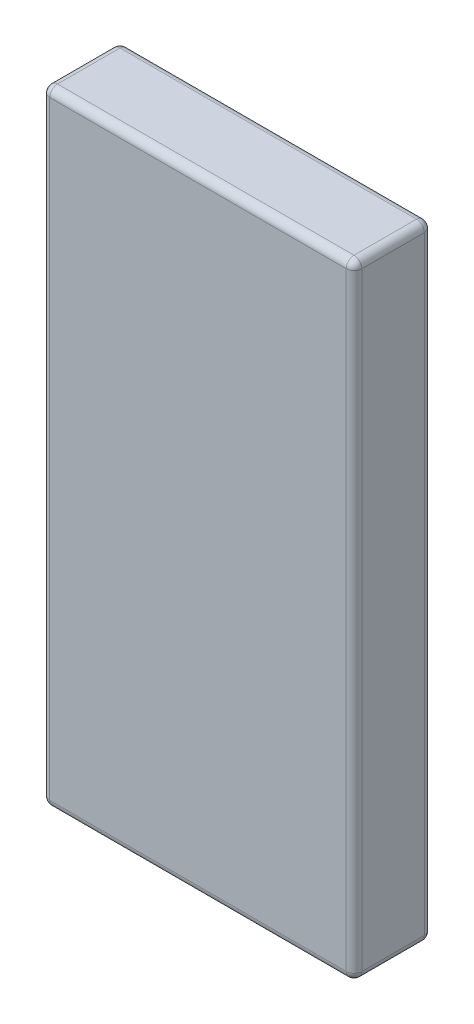
ISO-10303-21;
HEADER;
FILE_DESCRIPTION(('STEP AP214'),'2;1');
FILE_NAME('part.step','',(''),(''),'','','');
FILE_SCHEMA(('AUTOMOTIVE_DESIGN { 1 0 10303 214 1 1 1 1 }'));
ENDSEC;
DATA;
#1=APPLICATION_CONTEXT('core data for automotive mechanical design processes');
#2=APPLICATION_PROTOCOL_DEFINITION('international standard','automotive_design',2000,#1);
#3=PRODUCT_CONTEXT('',#1,'mechanical');
#4=PRODUCT('Part','Part','',(#3));
#5=PRODUCT_RELATED_PRODUCT_CATEGORY('part','',(#4));
#6=PRODUCT_DEFINITION_FORMATION('','',#4);
#7=PRODUCT_DEFINITION_CONTEXT('part definition',#1,'design');
#8=PRODUCT_DEFINITION('design','',#6,#7);
#9=PRODUCT_DEFINITION_SHAPE('','',#8);
#10=(LENGTH_UNIT() NAMED_UNIT(*) SI_UNIT(.MILLI.,.METRE.));
#11=(NAMED_UNIT(*) PLANE_ANGLE_UNIT() SI_UNIT($,.RADIAN.));
#12=(NAMED_UNIT(*) SI_UNIT($,.STERADIAN.) SOLID_ANGLE_UNIT());
#13=UNCERTAINTY_MEASURE_WITH_UNIT(LENGTH_MEASURE(1.E-05),#10,'distance_accuracy_value','');
#14=(GEOMETRIC_REPRESENTATION_CONTEXT(3) GLOBAL_UNCERTAINTY_ASSIGNED_CONTEXT((#13)) GLOBAL_UNIT_ASSIGNED_CONTEXT((#10,
#11,#12)) REPRESENTATION_CONTEXT('',''));
#15=CARTESIAN_POINT('',(0.,0.,0.));
#16=DIRECTION('',(0.,0.,1.));
#17=DIRECTION('',(1.,0.,0.));
#18=AXIS2_PLACEMENT_3D('',#15,#16,#17);
#19=CARTESIAN_POINT('',(12.7,25.4,6.35));
#20=DIRECTION('',(-1.,0.,0.));
#21=DIRECTION('',(0.,-1.,0.));
#22=AXIS2_PLACEMENT_3D('',#19,#20,#21);
#23=PLANE('',#22);
#24=DIRECTION('',(0.,0.,-1.));
#25=VECTOR('',#24,1.);
#26=CARTESIAN_POINT('',(12.7,24.765,6.35));
#27=LINE('',#26,#25);
#28=CARTESIAN_POINT('',(12.7,24.765,0.635));
#29=VERTEX_POINT('',#28);
#30=CARTESIAN_POINT('',(12.7,24.765,5.715));
#31=VERTEX_POINT('',#30);
#32=EDGE_CURVE('E175',#29,#31,#27,.F.);
#33=ORIENTED_EDGE('',*,*,#32,.T.);
#34=DIRECTION('',(0.,1.,0.));
#35=VECTOR('',#34,1.);
#36=CARTESIAN_POINT('',(12.7,-25.4,5.715));
#37=LINE('',#36,#35);
#38=CARTESIAN_POINT('',(12.7,-24.765,5.715));
#39=VERTEX_POINT('',#38);
#40=EDGE_CURVE('E180',#31,#39,#37,.F.);
#41=ORIENTED_EDGE('',*,*,#40,.T.);
#42=DIRECTION('',(0.,0.,-1.));
#43=VECTOR('',#42,1.);
#44=CARTESIAN_POINT('',(12.7,-24.765,6.35));
#45=LINE('',#44,#43);
#46=CARTESIAN_POINT('',(12.7,-24.765,0.635));
#47=VERTEX_POINT('',#46);
#48=EDGE_CURVE('E177',#39,#47,#45,.T.);
#49=ORIENTED_EDGE('',*,*,#48,.T.);
#50=DIRECTION('',(0.,1.,0.));
#51=VECTOR('',#50,1.);
#52=CARTESIAN_POINT('',(12.7,25.4,0.635));
#53=LINE('',#52,#51);
#54=EDGE_CURVE('E173',#47,#29,#53,.T.);
#55=ORIENTED_EDGE('',*,*,#54,.T.);
#56=EDGE_LOOP('',(#33,#41,#49,#55));
#57=FACE_BOUND('',#56,.T.);
#58=ADVANCED_FACE('F40',(#57),#23,.F.);
#59=CARTESIAN_POINT('',(-12.7,25.4,6.35));
#60=DIRECTION('',(0.,-1.,0.));
#61=DIRECTION('',(0.,0.,-1.));
#62=AXIS2_PLACEMENT_3D('',#59,#60,#61);
#63=PLANE('',#62);
#64=DIRECTION('',(0.,0.,-1.));
#65=VECTOR('',#64,1.);
#66=CARTESIAN_POINT('',(-12.065,25.4,6.35));
#67=LINE('',#66,#65);
#68=CARTESIAN_POINT('',(-12.065,25.4,0.635));
#69=VERTEX_POINT('',#68);
#70=CARTESIAN_POINT('',(-12.065,25.4,5.715));
#71=VERTEX_POINT('',#70);
#72=EDGE_CURVE('E184',#69,#71,#67,.F.);
#73=ORIENTED_EDGE('',*,*,#72,.T.);
#74=DIRECTION('',(-1.,0.,0.));
#75=VECTOR('',#74,1.);
#76=CARTESIAN_POINT('',(12.7,25.4,5.715));
#77=LINE('',#76,#75);
#78=CARTESIAN_POINT('',(12.065,25.4,5.715));
#79=VERTEX_POINT('',#78);
#80=EDGE_CURVE('E189',#71,#79,#77,.F.);
#81=ORIENTED_EDGE('',*,*,#80,.T.);
#82=DIRECTION('',(0.,0.,-1.));
#83=VECTOR('',#82,1.);
#84=CARTESIAN_POINT('',(12.065,25.4,6.35));
#85=LINE('',#84,#83);
#86=CARTESIAN_POINT('',(12.065,25.4,0.635));
#87=VERTEX_POINT('',#86);
#88=EDGE_CURVE('E186',#79,#87,#85,.T.);
#89=ORIENTED_EDGE('',*,*,#88,.T.);
#90=DIRECTION('',(-1.,0.,0.));
#91=VECTOR('',#90,1.);
#92=CARTESIAN_POINT('',(-12.7,25.4,0.635));
#93=LINE('',#92,#91);
#94=EDGE_CURVE('E182',#87,#69,#93,.T.);
#95=ORIENTED_EDGE('',*,*,#94,.T.);
#96=EDGE_LOOP('',(#73,#81,#89,#95));
#97=FACE_BOUND('',#96,.T.);
#98=ADVANCED_FACE('F298',(#97),#63,.F.);
#99=CARTESIAN_POINT('',(-12.7,25.4,6.35));
#100=DIRECTION('',(1.,0.,0.));
#101=DIRECTION('',(0.,1.,0.));
#102=AXIS2_PLACEMENT_3D('',#99,#100,#101);
#103=PLANE('',#102);
#104=DIRECTION('',(0.,0.,-1.));
#105=VECTOR('',#104,1.);
#106=CARTESIAN_POINT('',(-12.7,-24.765,6.35));
#107=LINE('',#106,#105);
#108=CARTESIAN_POINT('',(-12.7,-24.765,0.635));
#109=VERTEX_POINT('',#108);
#110=CARTESIAN_POINT('',(-12.7,-24.765,5.715));
#111=VERTEX_POINT('',#110);
#112=EDGE_CURVE('E135',#109,#111,#107,.F.);
#113=ORIENTED_EDGE('',*,*,#112,.T.);
#114=DIRECTION('',(0.,-1.,0.));
#115=VECTOR('',#114,1.);
#116=CARTESIAN_POINT('',(-12.7,25.4,5.715));
#117=LINE('',#116,#115);
#118=CARTESIAN_POINT('',(-12.7,24.765,5.715));
#119=VERTEX_POINT('',#118);
#120=EDGE_CURVE('E171',#111,#119,#117,.F.);
#121=ORIENTED_EDGE('',*,*,#120,.T.);
#122=DIRECTION('',(0.,0.,-1.));
#123=VECTOR('',#122,1.);
#124=CARTESIAN_POINT('',(-12.7,24.765,6.35));
#125=LINE('',#124,#123);
#126=CARTESIAN_POINT('',(-12.7,24.765,0.635));
#127=VERTEX_POINT('',#126);
#128=EDGE_CURVE('E168',#119,#127,#125,.T.);
#129=ORIENTED_EDGE('',*,*,#128,.T.);
#130=DIRECTION('',(0.,-1.,0.));
#131=VECTOR('',#130,1.);
#132=CARTESIAN_POINT('',(-12.7,25.4,0.635));
#133=LINE('',#132,#131);
#134=EDGE_CURVE('E163',#127,#109,#133,.T.);
#135=ORIENTED_EDGE('',*,*,#134,.T.);
#136=EDGE_LOOP('',(#113,#121,#129,#135));
#137=FACE_BOUND('',#136,.T.);
#138=ADVANCED_FACE('F314',(#137),#103,.F.);
#139=CARTESIAN_POINT('',(-12.7,-25.4,6.35));
#140=DIRECTION('',(0.,1.,0.));
#141=DIRECTION('',(0.,0.,1.));
#142=AXIS2_PLACEMENT_3D('',#139,#140,#141);
#143=PLANE('',#142);
#144=DIRECTION('',(0.,0.,-1.));
#145=VECTOR('',#144,1.);
#146=CARTESIAN_POINT('',(12.065,-25.4,6.35));
#147=LINE('',#146,#145);
#148=CARTESIAN_POINT('',(12.065,-25.4,0.635));
#149=VERTEX_POINT('',#148);
#150=CARTESIAN_POINT('',(12.065,-25.4,5.715));
#151=VERTEX_POINT('',#150);
#152=EDGE_CURVE('E156',#149,#151,#147,.F.);
#153=ORIENTED_EDGE('',*,*,#152,.T.);
#154=DIRECTION('',(1.,0.,0.));
#155=VECTOR('',#154,1.);
#156=CARTESIAN_POINT('',(-12.7,-25.4,5.715));
#157=LINE('',#156,#155);
#158=CARTESIAN_POINT('',(-12.065,-25.4,5.715));
#159=VERTEX_POINT('',#158);
#160=EDGE_CURVE('E160',#151,#159,#157,.F.);
#161=ORIENTED_EDGE('',*,*,#160,.T.);
#162=DIRECTION('',(0.,0.,-1.));
#163=VECTOR('',#162,1.);
#164=CARTESIAN_POINT('',(-12.065,-25.4,6.35));
#165=LINE('',#164,#163);
#166=CARTESIAN_POINT('',(-12.065,-25.4,0.635));
#167=VERTEX_POINT('',#166);
#168=EDGE_CURVE('E133',#159,#167,#165,.T.);
#169=ORIENTED_EDGE('',*,*,#168,.T.);
#170=DIRECTION('',(1.,0.,0.));
#171=VECTOR('',#170,1.);
#172=CARTESIAN_POINT('',(-12.7,-25.4,0.635));
#173=LINE('',#172,#171);
#174=EDGE_CURVE('E150',#167,#149,#173,.T.);
#175=ORIENTED_EDGE('',*,*,#174,.T.);
#176=EDGE_LOOP('',(#153,#161,#169,#175));
#177=FACE_BOUND('',#176,.T.);
#178=ADVANCED_FACE('F158',(#177),#143,.F.);
#179=CARTESIAN_POINT('',(0.,0.,6.35));
#180=DIRECTION('',(0.,0.,1.));
#181=DIRECTION('',(1.,0.,0.));
#182=AXIS2_PLACEMENT_3D('',#179,#180,#181);
#183=PLANE('',#182);
#184=DIRECTION('',(0.,-1.,0.));
#185=VECTOR('',#184,1.);
#186=CARTESIAN_POINT('',(-12.065,-25.4,6.35));
#187=LINE('',#186,#185);
#188=CARTESIAN_POINT('',(-12.065,24.765,6.35));
#189=VERTEX_POINT('',#188);
#190=CARTESIAN_POINT('',(-12.065,-24.765,6.35));
#191=VERTEX_POINT('',#190);
#192=EDGE_CURVE('E195',#189,#191,#187,.T.);
#193=ORIENTED_EDGE('',*,*,#192,.T.);
#194=DIRECTION('',(1.,0.,0.));
#195=VECTOR('',#194,1.);
#196=CARTESIAN_POINT('',(12.7,-24.765,6.35));
#197=LINE('',#196,#195);
#198=CARTESIAN_POINT('',(12.065,-24.765,6.35));
#199=VERTEX_POINT('',#198);
#200=EDGE_CURVE('E197',#191,#199,#197,.T.);
#201=ORIENTED_EDGE('',*,*,#200,.T.);
#202=DIRECTION('',(0.,1.,0.));
#203=VECTOR('',#202,1.);
#204=CARTESIAN_POINT('',(12.065,25.4,6.35));
#205=LINE('',#204,#203);
#206=CARTESIAN_POINT('',(12.065,24.765,6.35));
#207=VERTEX_POINT('',#206);
#208=EDGE_CURVE('E191',#199,#207,#205,.T.);
#209=ORIENTED_EDGE('',*,*,#208,.T.);
#210=DIRECTION('',(-1.,0.,0.));
#211=VECTOR('',#210,1.);
#212=CARTESIAN_POINT('',(-12.7,24.765,6.35));
#213=LINE('',#212,#211);
#214=EDGE_CURVE('E193',#207,#189,#213,.T.);
#215=ORIENTED_EDGE('',*,*,#214,.T.);
#216=EDGE_LOOP('',(#193,#201,#209,#215));
#217=FACE_BOUND('',#216,.T.);
#218=ADVANCED_FACE('F278',(#217),#183,.T.);
#219=CARTESIAN_POINT('',(0.,0.,0.));
#220=DIRECTION('',(0.,0.,1.));
#221=DIRECTION('',(1.,0.,0.));
#222=AXIS2_PLACEMENT_3D('',#219,#220,#221);
#223=PLANE('',#222);
#224=DIRECTION('',(0.,-1.,0.));
#225=VECTOR('',#224,1.);
#226=CARTESIAN_POINT('',(-12.065,0.,0.));
#227=LINE('',#226,#225);
#228=CARTESIAN_POINT('',(-12.065,-24.765,0.));
#229=VERTEX_POINT('',#228);
#230=CARTESIAN_POINT('',(-12.065,24.765,0.));
#231=VERTEX_POINT('',#230);
#232=EDGE_CURVE('E49',#229,#231,#227,.F.);
#233=ORIENTED_EDGE('',*,*,#232,.T.);
#234=DIRECTION('',(-1.,0.,0.));
#235=VECTOR('',#234,1.);
#236=CARTESIAN_POINT('',(0.,24.765,0.));
#237=LINE('',#236,#235);
#238=CARTESIAN_POINT('',(12.065,24.765,0.));
#239=VERTEX_POINT('',#238);
#240=EDGE_CURVE('E11',#231,#239,#237,.F.);
#241=ORIENTED_EDGE('',*,*,#240,.T.);
#242=DIRECTION('',(0.,1.,0.));
#243=VECTOR('',#242,1.);
#244=CARTESIAN_POINT('',(12.065,0.,0.));
#245=LINE('',#244,#243);
#246=CARTESIAN_POINT('',(12.065,-24.765,0.));
#247=VERTEX_POINT('',#246);
#248=EDGE_CURVE('E200',#239,#247,#245,.F.);
#249=ORIENTED_EDGE('',*,*,#248,.T.);
#250=DIRECTION('',(1.,0.,0.));
#251=VECTOR('',#250,1.);
#252=CARTESIAN_POINT('',(0.,-24.765,0.));
#253=LINE('',#252,#251);
#254=EDGE_CURVE('E60',#247,#229,#253,.F.);
#255=ORIENTED_EDGE('',*,*,#254,.T.);
#256=EDGE_LOOP('',(#233,#241,#249,#255));
#257=FACE_BOUND('',#256,.T.);
#258=ADVANCED_FACE('F524',(#257),#223,.F.);
#259=CARTESIAN_POINT('',(12.065,24.765,6.35));
#260=DIRECTION('',(0.,0.,-1.));
#261=DIRECTION('',(-1.,0.,0.));
#262=AXIS2_PLACEMENT_3D('',#259,#260,#261);
#263=CYLINDRICAL_SURFACE('',#262,0.635);
#264=CARTESIAN_POINT('',(12.065,24.765,5.715));
#265=DIRECTION('',(0.,0.,1.));
#266=DIRECTION('',(1.,0.,0.));
#267=AXIS2_PLACEMENT_3D('',#264,#265,#266);
#268=CIRCLE('',#267,0.635);
#269=EDGE_CURVE('E44',#31,#79,#268,.T.);
#270=ORIENTED_EDGE('',*,*,#269,.F.);
#271=ORIENTED_EDGE('',*,*,#32,.F.);
#272=CARTESIAN_POINT('',(12.065,24.765,0.635));
#273=DIRECTION('',(0.,0.,-1.));
#274=DIRECTION('',(-1.,0.,0.));
#275=AXIS2_PLACEMENT_3D('',#272,#273,#274);
#276=CIRCLE('',#275,0.635);
#277=EDGE_CURVE('E254',#87,#29,#276,.T.);
#278=ORIENTED_EDGE('',*,*,#277,.F.);
#279=ORIENTED_EDGE('',*,*,#88,.F.);
#280=EDGE_LOOP('',(#270,#271,#278,#279));
#281=FACE_BOUND('',#280,.T.);
#282=ADVANCED_FACE('F42',(#281),#263,.T.);
#283=CARTESIAN_POINT('',(12.065,24.765,5.715));
#284=DIRECTION('',(0.,1.,0.));
#285=DIRECTION('',(0.,0.,1.));
#286=AXIS2_PLACEMENT_3D('',#283,#284,#285);
#287=SPHERICAL_SURFACE('',#286,0.635);
#288=CARTESIAN_POINT('',(12.065,24.765,5.715));
#289=DIRECTION('',(0.,1.,0.));
#290=DIRECTION('',(0.,0.,1.));
#291=AXIS2_PLACEMENT_3D('',#288,#289,#290);
#292=CIRCLE('',#291,0.635);
#293=EDGE_CURVE('E249',#31,#207,#292,.F.);
#294=ORIENTED_EDGE('',*,*,#293,.F.);
#295=ORIENTED_EDGE('',*,*,#269,.T.);
#296=CARTESIAN_POINT('',(12.065,24.765,5.715));
#297=DIRECTION('',(1.,0.,0.));
#298=DIRECTION('',(0.,0.,-1.));
#299=AXIS2_PLACEMENT_3D('',#296,#297,#298);
#300=CIRCLE('',#299,0.635);
#301=EDGE_CURVE('E252',#207,#79,#300,.F.);
#302=ORIENTED_EDGE('',*,*,#301,.F.);
#303=EDGE_LOOP('',(#294,#295,#302));
#304=FACE_BOUND('',#303,.T.);
#305=ADVANCED_FACE('F265',(#304),#287,.T.);
#306=CARTESIAN_POINT('',(12.065,24.765,0.635));
#307=DIRECTION('',(1.,0.,0.));
#308=DIRECTION('',(0.,0.,-1.));
#309=AXIS2_PLACEMENT_3D('',#306,#307,#308);
#310=SPHERICAL_SURFACE('',#309,0.635);
#311=CARTESIAN_POINT('',(12.065,24.765,0.635));
#312=DIRECTION('',(1.,0.,0.));
#313=DIRECTION('',(0.,0.,-1.));
#314=AXIS2_PLACEMENT_3D('',#311,#312,#313);
#315=CIRCLE('',#314,0.635);
#316=EDGE_CURVE('E243',#87,#239,#315,.F.);
#317=ORIENTED_EDGE('',*,*,#316,.F.);
#318=ORIENTED_EDGE('',*,*,#277,.T.);
#319=CARTESIAN_POINT('',(12.065,24.765,0.635));
#320=DIRECTION('',(0.,1.,0.));
#321=DIRECTION('',(0.,0.,1.));
#322=AXIS2_PLACEMENT_3D('',#319,#320,#321);
#323=CIRCLE('',#322,0.635);
#324=EDGE_CURVE('E246',#239,#29,#323,.F.);
#325=ORIENTED_EDGE('',*,*,#324,.F.);
#326=EDGE_LOOP('',(#317,#318,#325));
#327=FACE_BOUND('',#326,.T.);
#328=ADVANCED_FACE('F497',(#327),#310,.T.);
#329=CARTESIAN_POINT('',(0.,24.765,5.715));
#330=DIRECTION('',(1.,0.,0.));
#331=DIRECTION('',(0.,0.,-1.));
#332=AXIS2_PLACEMENT_3D('',#329,#330,#331);
#333=CYLINDRICAL_SURFACE('',#332,0.635);
#334=ORIENTED_EDGE('',*,*,#301,.T.);
#335=ORIENTED_EDGE('',*,*,#80,.F.);
#336=CARTESIAN_POINT('',(-12.065,24.765,5.715));
#337=DIRECTION('',(-1.,0.,0.));
#338=DIRECTION('',(0.,0.,1.));
#339=AXIS2_PLACEMENT_3D('',#336,#337,#338);
#340=CIRCLE('',#339,0.635);
#341=EDGE_CURVE('E237',#189,#71,#340,.T.);
#342=ORIENTED_EDGE('',*,*,#341,.F.);
#343=ORIENTED_EDGE('',*,*,#214,.F.);
#344=EDGE_LOOP('',(#334,#335,#342,#343));
#345=FACE_BOUND('',#344,.T.);
#346=ADVANCED_FACE('F273',(#345),#333,.T.);
#347=CARTESIAN_POINT('',(12.065,0.,5.715));
#348=DIRECTION('',(0.,-1.,0.));
#349=DIRECTION('',(1.,0.,0.));
#350=AXIS2_PLACEMENT_3D('',#347,#348,#349);
#351=CYLINDRICAL_SURFACE('',#350,0.635);
#352=ORIENTED_EDGE('',*,*,#293,.T.);
#353=ORIENTED_EDGE('',*,*,#208,.F.);
#354=CARTESIAN_POINT('',(12.065,-24.765,5.715));
#355=DIRECTION('',(0.,-1.,0.));
#356=DIRECTION('',(0.,0.,-1.));
#357=AXIS2_PLACEMENT_3D('',#354,#355,#356);
#358=CIRCLE('',#357,0.635);
#359=EDGE_CURVE('E234',#39,#199,#358,.T.);
#360=ORIENTED_EDGE('',*,*,#359,.F.);
#361=ORIENTED_EDGE('',*,*,#40,.F.);
#362=EDGE_LOOP('',(#352,#353,#360,#361));
#363=FACE_BOUND('',#362,.T.);
#364=ADVANCED_FACE('F284',(#363),#351,.T.);
#365=CARTESIAN_POINT('',(12.065,-24.765,6.35));
#366=DIRECTION('',(0.,0.,-1.));
#367=DIRECTION('',(-1.,0.,0.));
#368=AXIS2_PLACEMENT_3D('',#365,#366,#367);
#369=CYLINDRICAL_SURFACE('',#368,0.635);
#370=CARTESIAN_POINT('',(12.065,-24.765,0.635));
#371=DIRECTION('',(0.,0.,-1.));
#372=DIRECTION('',(-1.,0.,0.));
#373=AXIS2_PLACEMENT_3D('',#370,#371,#372);
#374=CIRCLE('',#373,0.635);
#375=EDGE_CURVE('E228',#47,#149,#374,.T.);
#376=ORIENTED_EDGE('',*,*,#375,.F.);
#377=ORIENTED_EDGE('',*,*,#48,.F.);
#378=CARTESIAN_POINT('',(12.065,-24.765,5.715));
#379=DIRECTION('',(0.,0.,1.));
#380=DIRECTION('',(1.,0.,0.));
#381=AXIS2_PLACEMENT_3D('',#378,#379,#380);
#382=CIRCLE('',#381,0.635);
#383=EDGE_CURVE('E231',#151,#39,#382,.T.);
#384=ORIENTED_EDGE('',*,*,#383,.F.);
#385=ORIENTED_EDGE('',*,*,#152,.F.);
#386=EDGE_LOOP('',(#376,#377,#384,#385));
#387=FACE_BOUND('',#386,.T.);
#388=ADVANCED_FACE('F290',(#387),#369,.T.);
#389=CARTESIAN_POINT('',(12.065,25.4,0.635));
#390=DIRECTION('',(0.,1.,0.));
#391=DIRECTION('',(-1.,0.,0.));
#392=AXIS2_PLACEMENT_3D('',#389,#390,#391);
#393=CYLINDRICAL_SURFACE('',#392,0.635);
#394=ORIENTED_EDGE('',*,*,#324,.T.);
#395=ORIENTED_EDGE('',*,*,#54,.F.);
#396=CARTESIAN_POINT('',(12.065,-24.765,0.635));
#397=DIRECTION('',(0.,-1.,0.));
#398=DIRECTION('',(1.,0.,0.));
#399=AXIS2_PLACEMENT_3D('',#396,#397,#398);
#400=CIRCLE('',#399,0.635);
#401=EDGE_CURVE('E226',#247,#47,#400,.T.);
#402=ORIENTED_EDGE('',*,*,#401,.F.);
#403=ORIENTED_EDGE('',*,*,#248,.F.);
#404=EDGE_LOOP('',(#394,#395,#402,#403));
#405=FACE_BOUND('',#404,.T.);
#406=ADVANCED_FACE('F296',(#405),#393,.T.);
#407=CARTESIAN_POINT('',(-12.7,24.765,0.635));
#408=DIRECTION('',(-1.,0.,0.));
#409=DIRECTION('',(0.,0.,1.));
#410=AXIS2_PLACEMENT_3D('',#407,#408,#409);
#411=CYLINDRICAL_SURFACE('',#410,0.635);
#412=ORIENTED_EDGE('',*,*,#316,.T.);
#413=ORIENTED_EDGE('',*,*,#240,.F.);
#414=CARTESIAN_POINT('',(-12.065,24.765,0.635));
#415=DIRECTION('',(-1.,0.,0.));
#416=DIRECTION('',(0.,0.,1.));
#417=AXIS2_PLACEMENT_3D('',#414,#415,#416);
#418=CIRCLE('',#417,0.635);
#419=EDGE_CURVE('E223',#69,#231,#418,.T.);
#420=ORIENTED_EDGE('',*,*,#419,.F.);
#421=ORIENTED_EDGE('',*,*,#94,.F.);
#422=EDGE_LOOP('',(#412,#413,#420,#421));
#423=FACE_BOUND('',#422,.T.);
#424=ADVANCED_FACE('F307',(#423),#411,.T.);
#425=CARTESIAN_POINT('',(-12.065,24.765,6.35));
#426=DIRECTION('',(0.,0.,-1.));
#427=DIRECTION('',(-1.,0.,0.));
#428=AXIS2_PLACEMENT_3D('',#425,#426,#427);
#429=CYLINDRICAL_SURFACE('',#428,0.635);
#430=CARTESIAN_POINT('',(-12.065,24.765,5.715));
#431=DIRECTION('',(0.,0.,1.));
#432=DIRECTION('',(1.,0.,0.));
#433=AXIS2_PLACEMENT_3D('',#430,#431,#432);
#434=CIRCLE('',#433,0.635);
#435=EDGE_CURVE('E240',#71,#119,#434,.T.);
#436=ORIENTED_EDGE('',*,*,#435,.F.);
#437=ORIENTED_EDGE('',*,*,#72,.F.);
#438=CARTESIAN_POINT('',(-12.065,24.765,0.635));
#439=DIRECTION('',(0.,0.,-1.));
#440=DIRECTION('',(-1.,0.,0.));
#441=AXIS2_PLACEMENT_3D('',#438,#439,#440);
#442=CIRCLE('',#441,0.635);
#443=EDGE_CURVE('E220',#127,#69,#442,.T.);
#444=ORIENTED_EDGE('',*,*,#443,.F.);
#445=ORIENTED_EDGE('',*,*,#128,.F.);
#446=EDGE_LOOP('',(#436,#437,#444,#445));
#447=FACE_BOUND('',#446,.T.);
#448=ADVANCED_FACE('F303',(#447),#429,.T.);
#449=CARTESIAN_POINT('',(-12.065,24.765,5.715));
#450=DIRECTION('',(0.,1.,0.));
#451=DIRECTION('',(0.,0.,1.));
#452=AXIS2_PLACEMENT_3D('',#449,#450,#451);
#453=SPHERICAL_SURFACE('',#452,0.635);
#454=ORIENTED_EDGE('',*,*,#341,.T.);
#455=ORIENTED_EDGE('',*,*,#435,.T.);
#456=CARTESIAN_POINT('',(-12.065,24.765,5.715));
#457=DIRECTION('',(0.,1.,0.));
#458=DIRECTION('',(0.,0.,1.));
#459=AXIS2_PLACEMENT_3D('',#456,#457,#458);
#460=CIRCLE('',#459,0.635);
#461=EDGE_CURVE('E217',#189,#119,#460,.F.);
#462=ORIENTED_EDGE('',*,*,#461,.F.);
#463=EDGE_LOOP('',(#454,#455,#462));
#464=FACE_BOUND('',#463,.T.);
#465=ADVANCED_FACE('F317',(#464),#453,.T.);
#466=CARTESIAN_POINT('',(12.065,-24.765,5.715));
#467=DIRECTION('',(1.,0.,0.));
#468=DIRECTION('',(0.,1.,0.));
#469=AXIS2_PLACEMENT_3D('',#466,#467,#468);
#470=SPHERICAL_SURFACE('',#469,0.635);
#471=ORIENTED_EDGE('',*,*,#383,.T.);
#472=ORIENTED_EDGE('',*,*,#359,.T.);
#473=CARTESIAN_POINT('',(12.065,-24.765,5.715));
#474=DIRECTION('',(1.,0.,0.));
#475=DIRECTION('',(0.,0.,-1.));
#476=AXIS2_PLACEMENT_3D('',#473,#474,#475);
#477=CIRCLE('',#476,0.635);
#478=EDGE_CURVE('E215',#151,#199,#477,.F.);
#479=ORIENTED_EDGE('',*,*,#478,.F.);
#480=EDGE_LOOP('',(#471,#472,#479));
#481=FACE_BOUND('',#480,.T.);
#482=ADVANCED_FACE('F327',(#481),#470,.T.);
#483=CARTESIAN_POINT('',(12.065,-24.765,0.635));
#484=DIRECTION('',(1.,0.,0.));
#485=DIRECTION('',(0.,1.,0.));
#486=AXIS2_PLACEMENT_3D('',#483,#484,#485);
#487=SPHERICAL_SURFACE('',#486,0.635);
#488=ORIENTED_EDGE('',*,*,#401,.T.);
#489=ORIENTED_EDGE('',*,*,#375,.T.);
#490=CARTESIAN_POINT('',(12.065,-24.765,0.635));
#491=DIRECTION('',(1.,0.,0.));
#492=DIRECTION('',(0.,0.,-1.));
#493=AXIS2_PLACEMENT_3D('',#490,#491,#492);
#494=CIRCLE('',#493,0.635);
#495=EDGE_CURVE('E153',#247,#149,#494,.F.);
#496=ORIENTED_EDGE('',*,*,#495,.F.);
#497=EDGE_LOOP('',(#488,#489,#496));
#498=FACE_BOUND('',#497,.T.);
#499=ADVANCED_FACE('F329',(#498),#487,.T.);
#500=CARTESIAN_POINT('',(-12.065,24.765,0.635));
#501=DIRECTION('',(0.,1.,0.));
#502=DIRECTION('',(0.,0.,1.));
#503=AXIS2_PLACEMENT_3D('',#500,#501,#502);
#504=SPHERICAL_SURFACE('',#503,0.635);
#505=ORIENTED_EDGE('',*,*,#443,.T.);
#506=ORIENTED_EDGE('',*,*,#419,.T.);
#507=CARTESIAN_POINT('',(-12.065,24.765,0.635));
#508=DIRECTION('',(0.,1.,0.));
#509=DIRECTION('',(0.,0.,1.));
#510=AXIS2_PLACEMENT_3D('',#507,#508,#509);
#511=CIRCLE('',#510,0.635);
#512=EDGE_CURVE('E211',#127,#231,#511,.F.);
#513=ORIENTED_EDGE('',*,*,#512,.F.);
#514=EDGE_LOOP('',(#505,#506,#513));
#515=FACE_BOUND('',#514,.T.);
#516=ADVANCED_FACE('F309',(#515),#504,.T.);
#517=CARTESIAN_POINT('',(-12.065,0.,5.715));
#518=DIRECTION('',(0.,1.,0.));
#519=DIRECTION('',(-1.,0.,0.));
#520=AXIS2_PLACEMENT_3D('',#517,#518,#519);
#521=CYLINDRICAL_SURFACE('',#520,0.635);
#522=ORIENTED_EDGE('',*,*,#461,.T.);
#523=ORIENTED_EDGE('',*,*,#120,.F.);
#524=CARTESIAN_POINT('',(-12.065,-24.765,5.715));
#525=DIRECTION('',(0.,-1.,0.));
#526=DIRECTION('',(0.,0.,-1.));
#527=AXIS2_PLACEMENT_3D('',#524,#525,#526);
#528=CIRCLE('',#527,0.635);
#529=EDGE_CURVE('E208',#191,#111,#528,.T.);
#530=ORIENTED_EDGE('',*,*,#529,.F.);
#531=ORIENTED_EDGE('',*,*,#192,.F.);
#532=EDGE_LOOP('',(#522,#523,#530,#531));
#533=FACE_BOUND('',#532,.T.);
#534=ADVANCED_FACE('F319',(#533),#521,.T.);
#535=CARTESIAN_POINT('',(0.,-24.765,5.715));
#536=DIRECTION('',(-1.,0.,0.));
#537=DIRECTION('',(0.,0.,1.));
#538=AXIS2_PLACEMENT_3D('',#535,#536,#537);
#539=CYLINDRICAL_SURFACE('',#538,0.635);
#540=ORIENTED_EDGE('',*,*,#478,.T.);
#541=ORIENTED_EDGE('',*,*,#200,.F.);
#542=CARTESIAN_POINT('',(-12.065,-24.765,5.715));
#543=DIRECTION('',(-1.,0.,0.));
#544=DIRECTION('',(0.,0.,1.));
#545=AXIS2_PLACEMENT_3D('',#542,#543,#544);
#546=CIRCLE('',#545,0.635);
#547=EDGE_CURVE('E147',#159,#191,#546,.T.);
#548=ORIENTED_EDGE('',*,*,#547,.F.);
#549=ORIENTED_EDGE('',*,*,#160,.F.);
#550=EDGE_LOOP('',(#540,#541,#548,#549));
#551=FACE_BOUND('',#550,.T.);
#552=ADVANCED_FACE('F325',(#551),#539,.T.);
#553=CARTESIAN_POINT('',(-12.7,-24.765,0.635));
#554=DIRECTION('',(1.,0.,0.));
#555=DIRECTION('',(0.,0.,-1.));
#556=AXIS2_PLACEMENT_3D('',#553,#554,#555);
#557=CYLINDRICAL_SURFACE('',#556,0.635);
#558=ORIENTED_EDGE('',*,*,#495,.T.);
#559=ORIENTED_EDGE('',*,*,#174,.F.);
#560=CARTESIAN_POINT('',(-12.065,-24.765,0.635));
#561=DIRECTION('',(-1.,0.,0.));
#562=DIRECTION('',(0.,0.,1.));
#563=AXIS2_PLACEMENT_3D('',#560,#561,#562);
#564=CIRCLE('',#563,0.635);
#565=EDGE_CURVE('E141',#229,#167,#564,.T.);
#566=ORIENTED_EDGE('',*,*,#565,.F.);
#567=ORIENTED_EDGE('',*,*,#254,.F.);
#568=EDGE_LOOP('',(#558,#559,#566,#567));
#569=FACE_BOUND('',#568,.T.);
#570=ADVANCED_FACE('F151',(#569),#557,.T.);
#571=CARTESIAN_POINT('',(-12.065,25.4,0.635));
#572=DIRECTION('',(0.,-1.,0.));
#573=DIRECTION('',(1.,0.,0.));
#574=AXIS2_PLACEMENT_3D('',#571,#572,#573);
#575=CYLINDRICAL_SURFACE('',#574,0.635);
#576=ORIENTED_EDGE('',*,*,#512,.T.);
#577=ORIENTED_EDGE('',*,*,#232,.F.);
#578=CARTESIAN_POINT('',(-12.065,-24.765,0.635));
#579=DIRECTION('',(0.,-1.,0.));
#580=DIRECTION('',(0.,0.,-1.));
#581=AXIS2_PLACEMENT_3D('',#578,#579,#580);
#582=CIRCLE('',#581,0.635);
#583=EDGE_CURVE('E145',#109,#229,#582,.T.);
#584=ORIENTED_EDGE('',*,*,#583,.F.);
#585=ORIENTED_EDGE('',*,*,#134,.F.);
#586=EDGE_LOOP('',(#576,#577,#584,#585));
#587=FACE_BOUND('',#586,.T.);
#588=ADVANCED_FACE('F312',(#587),#575,.T.);
#589=CARTESIAN_POINT('',(-12.065,-24.765,5.715));
#590=DIRECTION('',(0.,0.,1.));
#591=DIRECTION('',(1.,0.,0.));
#592=AXIS2_PLACEMENT_3D('',#589,#590,#591);
#593=SPHERICAL_SURFACE('',#592,0.635);
#594=ORIENTED_EDGE('',*,*,#547,.T.);
#595=ORIENTED_EDGE('',*,*,#529,.T.);
#596=CARTESIAN_POINT('',(-12.065,-24.765,5.715));
#597=DIRECTION('',(0.,0.,1.));
#598=DIRECTION('',(1.,0.,0.));
#599=AXIS2_PLACEMENT_3D('',#596,#597,#598);
#600=CIRCLE('',#599,0.635);
#601=EDGE_CURVE('E138',#159,#111,#600,.F.);
#602=ORIENTED_EDGE('',*,*,#601,.F.);
#603=EDGE_LOOP('',(#594,#595,#602));
#604=FACE_BOUND('',#603,.T.);
#605=ADVANCED_FACE('F323',(#604),#593,.T.);
#606=CARTESIAN_POINT('',(-12.065,-24.765,0.635));
#607=DIRECTION('',(0.,0.,-1.));
#608=DIRECTION('',(-1.,0.,0.));
#609=AXIS2_PLACEMENT_3D('',#606,#607,#608);
#610=SPHERICAL_SURFACE('',#609,0.635);
#611=ORIENTED_EDGE('',*,*,#583,.T.);
#612=ORIENTED_EDGE('',*,*,#565,.T.);
#613=CARTESIAN_POINT('',(-12.065,-24.765,0.635));
#614=DIRECTION('',(0.,0.,-1.));
#615=DIRECTION('',(-1.,0.,0.));
#616=AXIS2_PLACEMENT_3D('',#613,#614,#615);
#617=CIRCLE('',#616,0.635);
#618=EDGE_CURVE('E129',#109,#167,#617,.F.);
#619=ORIENTED_EDGE('',*,*,#618,.F.);
#620=EDGE_LOOP('',(#611,#612,#619));
#621=FACE_BOUND('',#620,.T.);
#622=ADVANCED_FACE('F143',(#621),#610,.T.);
#623=CARTESIAN_POINT('',(-12.065,-24.765,6.35));
#624=DIRECTION('',(0.,0.,-1.));
#625=DIRECTION('',(-1.,0.,0.));
#626=AXIS2_PLACEMENT_3D('',#623,#624,#625);
#627=CYLINDRICAL_SURFACE('',#626,0.635);
#628=ORIENTED_EDGE('',*,*,#601,.T.);
#629=ORIENTED_EDGE('',*,*,#112,.F.);
#630=ORIENTED_EDGE('',*,*,#618,.T.);
#631=ORIENTED_EDGE('',*,*,#168,.F.);
#632=EDGE_LOOP('',(#628,#629,#630,#631));
#633=FACE_BOUND('',#632,.T.);
#634=ADVANCED_FACE('F131',(#633),#627,.T.);
#635=CLOSED_SHELL('',(#58,#98,#138,#178,#218,#258,#282,#305,#328,#346,#364,#388,#406,#424,#448,
#465,#482,#499,#516,#534,#552,#570,#588,#605,#622,#634));
#636=MANIFOLD_SOLID_BREP('B2',#635);
#637=ADVANCED_BREP_SHAPE_REPRESENTATION('',(#18,#636),#14);
#638=SHAPE_DEFINITION_REPRESENTATION(#9,#637);
ENDSEC;
END-ISO-10303-21;
